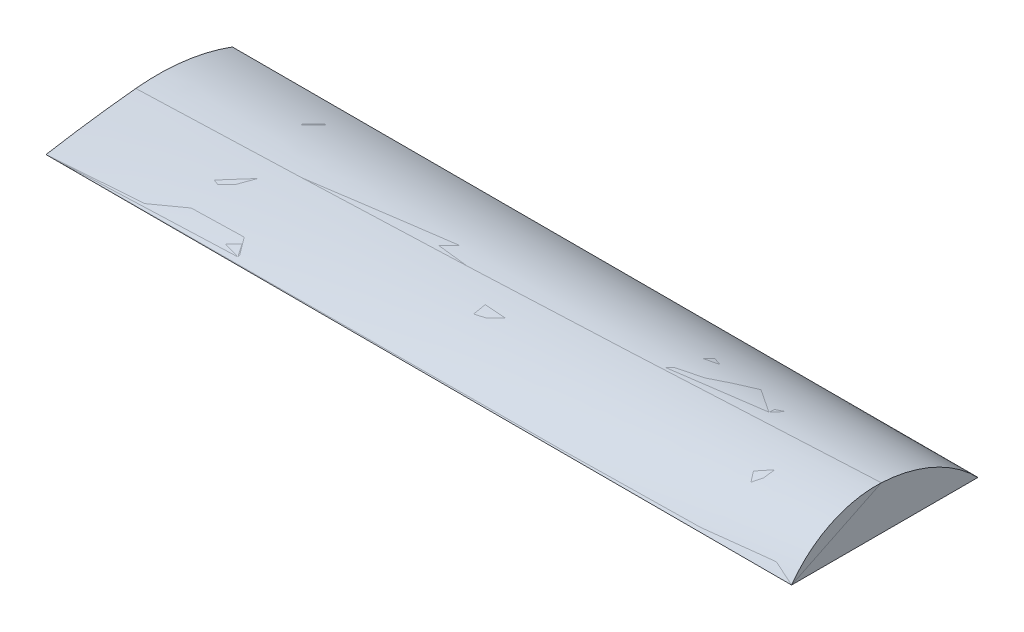
ISO-10303-21;
HEADER;
FILE_DESCRIPTION(('STEP AP214'),'2;1');
FILE_NAME('part.step','',(''),(''),'','','');
FILE_SCHEMA(('AUTOMOTIVE_DESIGN { 1 0 10303 214 1 1 1 1 }'));
ENDSEC;
DATA;
#1=APPLICATION_CONTEXT('core data for automotive mechanical design processes');
#2=APPLICATION_PROTOCOL_DEFINITION('international standard','automotive_design',2000,#1);
#3=PRODUCT_CONTEXT('',#1,'mechanical');
#4=PRODUCT('Part','Part','',(#3));
#5=PRODUCT_RELATED_PRODUCT_CATEGORY('part','',(#4));
#6=PRODUCT_DEFINITION_FORMATION('','',#4);
#7=PRODUCT_DEFINITION_CONTEXT('part definition',#1,'design');
#8=PRODUCT_DEFINITION('design','',#6,#7);
#9=PRODUCT_DEFINITION_SHAPE('','',#8);
#10=(LENGTH_UNIT() NAMED_UNIT(*) SI_UNIT(.MILLI.,.METRE.));
#11=(NAMED_UNIT(*) PLANE_ANGLE_UNIT() SI_UNIT($,.RADIAN.));
#12=(NAMED_UNIT(*) SI_UNIT($,.STERADIAN.) SOLID_ANGLE_UNIT());
#13=UNCERTAINTY_MEASURE_WITH_UNIT(LENGTH_MEASURE(1.E-05),#10,'distance_accuracy_value','');
#14=(GEOMETRIC_REPRESENTATION_CONTEXT(3) GLOBAL_UNCERTAINTY_ASSIGNED_CONTEXT((#13)) GLOBAL_UNIT_ASSIGNED_CONTEXT((#10,
#11,#12)) REPRESENTATION_CONTEXT('',''));
#15=CARTESIAN_POINT('',(0.,0.,0.));
#16=DIRECTION('',(0.,0.,1.));
#17=DIRECTION('',(1.,0.,0.));
#18=AXIS2_PLACEMENT_3D('',#15,#16,#17);
#19=CARTESIAN_POINT('',(3048.,357.029468650609,27.7196009830328));
#20=CARTESIAN_POINT('',(2032.06565410916,305.807060138827,27.7196009830331));
#21=CARTESIAN_POINT('',(0.459460026641767,203.375477990563,27.7196009830337));
#22=CARTESIAN_POINT('',(-2031.93437981395,135.09915754925,27.7196009830325));
#23=CARTESIAN_POINT('',(-3048.,100.965408217149,27.7196009830318));
#24=CARTESIAN_POINT('',(3048.,355.088474416726,-9.18765761877458));
#25=CARTESIAN_POINT('',(2032.06565410916,305.416517274933,-8.33612498554589));
#26=CARTESIAN_POINT('',(0.459460026641767,206.085437260132,-6.63327973857884));
#27=CARTESIAN_POINT('',(-2031.93437981395,138.256317849937,-5.9257886405661));
#28=CARTESIAN_POINT('',(-3048.,104.346140142649,-5.57208879795351));
#29=CARTESIAN_POINT('',(3048.,347.771369274783,-82.8214757845803));
#30=CARTESIAN_POINT('',(2032.06565410916,301.400034870182,-80.4082955218791));
#31=CARTESIAN_POINT('',(0.459460026641989,208.669347512968,-75.5825585153776));
#32=CARTESIAN_POINT('',(-2031.93437981395,142.356994766912,-73.426514928613));
#33=CARTESIAN_POINT('',(-3048.,109.205102403273,-72.3486324231701));
#34=CARTESIAN_POINT('',(3048.,326.584084138001,-191.775336090493));
#35=CARTESIAN_POINT('',(2032.06565410916,285.718343395966,-187.533693604311));
#36=CARTESIAN_POINT('',(0.459460026641101,203.997420825434,-179.051504589966));
#37=CARTESIAN_POINT('',(-2031.93437981395,141.843835621411,-174.860976147701));
#38=CARTESIAN_POINT('',(-3048.,110.771058357894,-172.765982649329));
#39=CARTESIAN_POINT('',(3048.,295.369062928028,-298.290389942061));
#40=CARTESIAN_POINT('',(2032.06565410916,260.50899486405,-292.819188382958));
#41=CARTESIAN_POINT('',(0.459460026640546,190.797865900481,-281.878198916951));
#42=CARTESIAN_POINT('',(-2031.93437981395,134.663233778749,-276.03175468013));
#43=CARTESIAN_POINT('',(-3048.,106.599544211004,-273.108910262419));
#44=CARTESIAN_POINT('',(3047.99999999999,254.39579806938,-401.445762945769));
#45=CARTESIAN_POINT('',(2032.06565410915,225.974502752165,-395.42274883089));
#46=CARTESIAN_POINT('',(0.459460026644765,169.139255628326,-383.378276830975));
#47=CARTESIAN_POINT('',(-2031.93437981395,120.853606673482,-376.493025001473));
#48=CARTESIAN_POINT('',(-3048.,96.7139016174797,-373.050843898016));
#49=CARTESIAN_POINT('',(3048.00000000001,204.018747874501,-500.349717499533));
#50=CARTESIAN_POINT('',(2032.06565410916,182.393619242813,-494.524216022473));
#51=CARTESIAN_POINT('',(0.459460026640546,139.148949492579,-482.874718264766));
#52=CARTESIAN_POINT('',(-2031.93437981395,100.472965583307,-475.801409575772));
#53=CARTESIAN_POINT('',(-3048.,81.1374722321939,-472.265212191698));
#54=CARTESIAN_POINT('',(3047.99999999999,144.673229990741,-594.147072223697));
#55=CARTESIAN_POINT('',(2032.06565410915,130.115112109361,-589.331310253587));
#56=CARTESIAN_POINT('',(0.459460026644321,101.002637881453,-579.701030612708));
#57=CARTESIAN_POINT('',(-2031.93437981395,73.6195841472809,-573.52012772952));
#58=CARTESIAN_POINT('',(-3048.,59.9298263210211,-570.43007559582));
#59=CARTESIAN_POINT('',(3048.00000000001,76.8725640331372,-682.027186144494));
#60=CARTESIAN_POINT('',(2032.06565410916,69.5587832278572,-679.086866649359));
#61=CARTESIAN_POINT('',(0.459460026639436,54.9331113561778,-673.206987380527));
#62=CARTESIAN_POINT('',(-2031.93437981395,40.4107677559007,-669.21782035926));
#63=CARTESIAN_POINT('',(-3048.,33.1505341498355,-667.223494562737));
#64=CARTESIAN_POINT('',(3048.,26.4258089430827,-736.162240464383));
#65=CARTESIAN_POINT('',(2032.06565410916,23.9914846027125,-735.077740652571));
#66=CARTESIAN_POINT('',(0.459460026641767,19.1234649040918,-732.90902124263));
#67=CARTESIAN_POINT('',(-2031.93437981395,14.1394388830836,-731.389406125531));
#68=CARTESIAN_POINT('',(-3048.,11.6477478580526,-730.629696739421));
#69=CARTESIAN_POINT('',(3048.,2.22044604925031E-13,-762.));
#70=CARTESIAN_POINT('',(2032.06565410916,0.,-762.));
#71=CARTESIAN_POINT('',(0.459460026641767,-4.99617109103717E-13,-762.000000000001));
#72=CARTESIAN_POINT('',(-2031.93437981395,1.29547534353127E-13,-762.));
#73=CARTESIAN_POINT('',(-3048.,4.44089209850063E-13,-762.));
#74=B_SPLINE_SURFACE_WITH_KNOTS('',3,3,((#19,#20,#21,#22,#23),(#24,#25,#26,#27,#28),(#29,#30,
#31,#32,#33),(#34,#35,#36,#37,#38),(#39,#40,#41,#42,#43),(#44,#45,#46,#47,#48),(#49,#50,#51,#52,
#53),(#54,#55,#56,#57,#58),(#59,#60,#61,#62,#63),(#64,#65,#66,#67,#68),(#69,#70,#71,#72,#73)),
.UNSPECIFIED.,.F.,.F.,.F.,(4,1,1,1,1,1,1,1,4),(4,1,4),(0.,0.125,0.25,0.375,0.5,0.625,0.75,0.875,
1.),(0.,0.500064603489578,1.),.UNSPECIFIED.);
#75=CARTESIAN_POINT('',(3048.,-833.356731227227,90.3233498819976));
#76=DIRECTION('',(-1.,0.,0.));
#77=DIRECTION('',(0.,0.,-1.));
#78=AXIS2_PLACEMENT_3D('',#75,#76,#77);
#79=CIRCLE('',#78,1192.03126395066);
#80=CARTESIAN_POINT('',(3048.,357.029468650609,27.7196009830328));
#81=VERTEX_POINT('',#80);
#82=CARTESIAN_POINT('',(3048.,2.22044604925031E-13,-762.));
#83=VERTEX_POINT('',#82);
#84=EDGE_CURVE('E178',#81,#83,#79,.T.);
#85=DIRECTION('',(-1.,0.,0.));
#86=VECTOR('',#85,1.);
#87=CARTESIAN_POINT('',(0.393822875752819,0.,-762.));
#88=LINE('',#87,#86);
#89=CARTESIAN_POINT('',(-3048.,2.22044604925031E-13,-762.));
#90=VERTEX_POINT('',#89);
#91=EDGE_CURVE('E180',#83,#90,#88,.T.);
#92=CARTESIAN_POINT('',(-3048.,-1648.45305250207,-149.931785297438));
#93=DIRECTION('',(-1.,0.,0.));
#94=DIRECTION('',(0.,0.,-1.));
#95=AXIS2_PLACEMENT_3D('',#92,#93,#94);
#96=CIRCLE('',#95,1758.41547017551);
#97=CARTESIAN_POINT('',(-3048.,100.965408217149,27.7196009830318));
#98=VERTEX_POINT('',#97);
#99=EDGE_CURVE('E195',#98,#90,#96,.T.);
#100=CARTESIAN_POINT('',(3048.,357.029468650609,27.7196009830328));
#101=CARTESIAN_POINT('',(2032.06565410916,305.807060138827,27.7196009830331));
#102=CARTESIAN_POINT('',(0.459460026641767,203.375477990563,27.7196009830336));
#103=CARTESIAN_POINT('',(-2031.93437981395,135.09915754925,27.7196009830324));
#104=CARTESIAN_POINT('',(-3048.,100.965408217149,27.7196009830318));
#105=B_SPLINE_CURVE_WITH_KNOTS('',3,(#100,#101,#102,#103,#104),.UNSPECIFIED.,.F.,.F.,(4,1,4),
(0.,0.500064603489578,1.),.UNSPECIFIED.);
#106=EDGE_CURVE('E183',#81,#98,#105,.T.);
#107=ORIENTED_EDGE('',*,*,#84,.T.);
#108=ORIENTED_EDGE('',*,*,#91,.T.);
#109=ORIENTED_EDGE('',*,*,#99,.F.);
#110=ORIENTED_EDGE('',*,*,#106,.F.);
#111=EDGE_LOOP('',(#107,#108,#109,#110));
#112=FACE_BOUND('',#111,.T.);
#113=ADVANCED_FACE('F133',(#112),#74,.T.);
#114=CARTESIAN_POINT('',(-3048.,-10303.5740928413,-1028.84914313158));
#115=DIRECTION('',(-1.,0.,0.));
#116=DIRECTION('',(0.,0.,1.));
#117=AXIS2_PLACEMENT_3D('',#114,#115,#116);
#118=PLANE('',#117);
#119=ORIENTED_EDGE('',*,*,#99,.T.);
#120=DIRECTION('',(0.,0.,1.));
#121=VECTOR('',#120,1.);
#122=CARTESIAN_POINT('',(-3048.,1.11022302462516E-13,0.));
#123=LINE('',#122,#121);
#124=CARTESIAN_POINT('',(-3048.,0.,762.));
#125=VERTEX_POINT('',#124);
#126=EDGE_CURVE('E162',#90,#125,#123,.T.);
#127=ORIENTED_EDGE('',*,*,#126,.T.);
#128=CARTESIAN_POINT('',(-3048.,-10303.5740928413,-1028.84914313158));
#129=DIRECTION('',(-1.,0.,0.));
#130=DIRECTION('',(0.,0.,-1.));
#131=AXIS2_PLACEMENT_3D('',#128,#129,#130);
#132=CIRCLE('',#131,10458.048562716);
#133=EDGE_CURVE('E203',#125,#98,#132,.T.);
#134=ORIENTED_EDGE('',*,*,#133,.T.);
#135=EDGE_LOOP('',(#119,#127,#134));
#136=FACE_BOUND('',#135,.T.);
#137=ADVANCED_FACE('F328',(#136),#118,.T.);
#138=CARTESIAN_POINT('',(3048.,2.22044604925031E-13,-762.));
#139=DIRECTION('',(0.,-1.,0.));
#140=DIRECTION('',(0.,0.,1.));
#141=AXIS2_PLACEMENT_3D('',#138,#139,#140);
#142=PLANE('',#141);
#143=DIRECTION('',(0.,0.,1.));
#144=VECTOR('',#143,1.);
#145=CARTESIAN_POINT('',(3048.,1.11022302462516E-13,0.));
#146=LINE('',#145,#144);
#147=CARTESIAN_POINT('',(3048.,1.66533453693773E-13,762.));
#148=VERTEX_POINT('',#147);
#149=EDGE_CURVE('E153',#83,#148,#146,.T.);
#150=ORIENTED_EDGE('',*,*,#149,.T.);
#151=DIRECTION('',(-1.,0.,0.));
#152=VECTOR('',#151,1.);
#153=CARTESIAN_POINT('',(0.393822875752819,2.22055364725921E-13,761.999999999999));
#154=LINE('',#153,#152);
#155=EDGE_CURVE('E146',#148,#125,#154,.T.);
#156=ORIENTED_EDGE('',*,*,#155,.T.);
#157=ORIENTED_EDGE('',*,*,#126,.F.);
#158=ORIENTED_EDGE('',*,*,#91,.F.);
#159=EDGE_LOOP('',(#150,#156,#157,#158));
#160=FACE_BOUND('',#159,.T.);
#161=ADVANCED_FACE('F192',(#160),#142,.T.);
#162=CARTESIAN_POINT('',(3048.,-485.437757623856,72.0258998083268));
#163=DIRECTION('',(-1.,0.,0.));
#164=DIRECTION('',(0.,0.,1.));
#165=AXIS2_PLACEMENT_3D('',#162,#163,#164);
#166=PLANE('',#165);
#167=CARTESIAN_POINT('',(3048.,-485.437757623856,72.0258998083268));
#168=DIRECTION('',(-1.,0.,0.));
#169=DIRECTION('',(0.,0.,-1.));
#170=AXIS2_PLACEMENT_3D('',#167,#168,#169);
#171=CIRCLE('',#170,843.631480838753);
#172=EDGE_CURVE('E13',#148,#81,#171,.T.);
#173=ORIENTED_EDGE('',*,*,#172,.F.);
#174=ORIENTED_EDGE('',*,*,#149,.F.);
#175=ORIENTED_EDGE('',*,*,#84,.F.);
#176=EDGE_LOOP('',(#173,#174,#175));
#177=FACE_BOUND('',#176,.T.);
#178=ADVANCED_FACE('F200',(#177),#166,.F.);
#179=CARTESIAN_POINT('',(3048.,1.66533453693773E-13,762.));
#180=CARTESIAN_POINT('',(2032.06565410916,2.0817458848352E-13,762.));
#181=CARTESIAN_POINT('',(0.459460026641767,2.91446098802716E-13,761.999999999999));
#182=CARTESIAN_POINT('',(-2031.93437981395,0.,762.));
#183=CARTESIAN_POINT('',(-3048.,0.,762.));
#184=CARTESIAN_POINT('',(3048.,29.0429711531695,741.566544907392));
#185=CARTESIAN_POINT('',(2032.06565410916,24.2371026730112,738.550355351954));
#186=CARTESIAN_POINT('',(0.459460026641767,14.6266074557498,732.518755565864));
#187=CARTESIAN_POINT('',(-2031.93437981395,8.4016222990255,731.884160631592));
#188=CARTESIAN_POINT('',(-3048.,5.28953187642705,731.566904161504));
#189=CARTESIAN_POINT('',(3048.,84.5453723552376,697.027775172461));
#190=CARTESIAN_POINT('',(2032.06565410916,70.4457511191001,689.08358478242));
#191=CARTESIAN_POINT('',(0.459460026641323,42.2501517150495,673.197256626809));
#192=CARTESIAN_POINT('',(-2031.93437981395,24.4819010655734,671.501573315269));
#193=CARTESIAN_POINT('',(-3048.,15.5989236318311,670.653841206558));
#194=CARTESIAN_POINT('',(3048.,158.721372485365,620.265381851068));
#195=CARTESIAN_POINT('',(2032.06565410916,132.12375937084,607.933020626898));
#196=CARTESIAN_POINT('',(0.459460026642766,78.9354054483259,583.271484621126));
#197=CARTESIAN_POINT('',(-2031.93437981395,46.4789445969054,580.524251156607));
#198=CARTESIAN_POINT('',(-3048.,30.2528109718255,579.150811905216));
#199=CARTESIAN_POINT('',(3048.00000000001,222.639379242981,534.772697088081));
#200=CARTESIAN_POINT('',(2032.06565410916,185.414016794622,520.678936224319));
#201=CARTESIAN_POINT('',(0.459460026639769,110.972910208411,492.495056050811));
#202=CARTESIAN_POINT('',(-2031.93437981395,66.3859255649033,489.179227007448));
#203=CARTESIAN_POINT('',(-3048.,44.0953137179471,487.521526699893));
#204=CARTESIAN_POINT('',(3047.99999999999,275.280986029378,441.910495941741));
#205=CARTESIAN_POINT('',(2032.06565410915,229.67378287563,428.254517465996));
#206=CARTESIAN_POINT('',(0.459460026644987,138.47116058345,400.94608895406));
#207=CARTESIAN_POINT('',(-2031.93437981395,84.238303362931,397.497337764328));
#208=CARTESIAN_POINT('',(-3048.,57.1253783844976,395.773184970824));
#209=CARTESIAN_POINT('',(3048.,315.808296145767,343.157955207196));
#210=CARTESIAN_POINT('',(2032.06565410916,264.365612597069,331.662016648247));
#211=CARTESIAN_POINT('',(0.459460026640768,161.493537289764,308.67310985755));
#212=CARTESIAN_POINT('',(-2031.93437981395,100.056500722473,305.499557336302));
#213=CARTESIAN_POINT('',(-3048.,69.3419514857788,303.912986098246));
#214=CARTESIAN_POINT('',(3048.,343.575379924687,240.087591890367));
#215=CARTESIAN_POINT('',(2032.06565410916,289.07946806479,231.962587520926));
#216=CARTESIAN_POINT('',(0.459460026640768,180.101725029969,215.714678125336));
#217=CARTESIAN_POINT('',(-2031.93437981395,113.860458253997,213.203548966914));
#218=CARTESIAN_POINT('',(-3048.,80.7441042829981,211.94814661541));
#219=CARTESIAN_POINT('',(3047.99999999999,358.140910336441,134.340774692125));
#220=CARTESIAN_POINT('',(2032.06565410915,303.52466072033,130.257546581266));
#221=CARTESIAN_POINT('',(0.459460026642988,194.306273266018,122.092145386369));
#222=CARTESIAN_POINT('',(-2031.93437981395,125.653072956041,120.621240482108));
#223=CARTESIAN_POINT('',(-3048.,91.3309080373627,119.885883055567));
#224=CARTESIAN_POINT('',(3048.,358.894446710407,63.1814412802017));
#225=CARTESIAN_POINT('',(2032.06565410916,306.207053153412,61.8698764540038));
#226=CARTESIAN_POINT('',(0.459460026641767,200.845879438396,59.2470856844804));
#227=CARTESIAN_POINT('',(-2031.93437981395,132.1754553575,58.7162808688702));
#228=CARTESIAN_POINT('',(-3048.,97.8446796660789,58.4509127529084));
#229=CARTESIAN_POINT('',(3048.,357.029468650609,27.7196009830328));
#230=CARTESIAN_POINT('',(2032.06565410916,305.807060138827,27.7196009830331));
#231=CARTESIAN_POINT('',(0.459460026641767,203.375477990563,27.7196009830336));
#232=CARTESIAN_POINT('',(-2031.93437981395,135.09915754925,27.7196009830324));
#233=CARTESIAN_POINT('',(-3048.,100.965408217149,27.7196009830318));
#234=B_SPLINE_SURFACE_WITH_KNOTS('',3,3,((#179,#180,#181,#182,#183),(#184,#185,#186,#187,#188),
(#189,#190,#191,#192,#193),(#194,#195,#196,#197,#198),(#199,#200,#201,#202,#203),(#204,#205,
#206,#207,#208),(#209,#210,#211,#212,#213),(#214,#215,#216,#217,#218),(#219,#220,#221,#222,
#223),(#224,#225,#226,#227,#228),(#229,#230,#231,#232,#233)),.UNSPECIFIED.,.F.,.F.,.F.,(4,1,1,1,
1,1,1,1,4),(4,1,4),(0.,0.125,0.25,0.375,0.5,0.625,0.75,0.875,1.),(0.,0.500064603489578,1.),.UNSPECIFIED.);
#235=ORIENTED_EDGE('',*,*,#172,.T.);
#236=ORIENTED_EDGE('',*,*,#106,.T.);
#237=ORIENTED_EDGE('',*,*,#133,.F.);
#238=ORIENTED_EDGE('',*,*,#155,.F.);
#239=EDGE_LOOP('',(#235,#236,#237,#238));
#240=FACE_BOUND('',#239,.T.);
#241=ADVANCED_FACE('F135',(#240),#234,.T.);
#242=CLOSED_SHELL('',(#113,#137,#161,#178,#241));
#243=MANIFOLD_SOLID_BREP('B2',#242);
#244=CARTESIAN_POINT('',(3048.,357.029468650609,27.7196009830328));
#245=CARTESIAN_POINT('',(2032.06565410916,305.807060138827,27.7196009830331));
#246=CARTESIAN_POINT('',(0.459460026641767,203.375477990563,27.7196009830337));
#247=CARTESIAN_POINT('',(-2031.93437981395,135.09915754925,27.7196009830325));
#248=CARTESIAN_POINT('',(-3048.,100.965408217149,27.7196009830318));
#249=CARTESIAN_POINT('',(3048.,355.088474416726,-9.18765761877458));
#250=CARTESIAN_POINT('',(2032.06565410916,305.416517274933,-8.33612498554589));
#251=CARTESIAN_POINT('',(0.459460026641767,206.085437260132,-6.63327973857884));
#252=CARTESIAN_POINT('',(-2031.93437981395,138.256317849937,-5.9257886405661));
#253=CARTESIAN_POINT('',(-3048.,104.346140142649,-5.57208879795351));
#254=CARTESIAN_POINT('',(3048.,347.771369274783,-82.8214757845803));
#255=CARTESIAN_POINT('',(2032.06565410916,301.400034870182,-80.4082955218791));
#256=CARTESIAN_POINT('',(0.459460026641989,208.669347512968,-75.5825585153776));
#257=CARTESIAN_POINT('',(-2031.93437981395,142.356994766912,-73.426514928613));
#258=CARTESIAN_POINT('',(-3048.,109.205102403273,-72.3486324231701));
#259=CARTESIAN_POINT('',(3048.,326.584084138001,-191.775336090493));
#260=CARTESIAN_POINT('',(2032.06565410916,285.718343395966,-187.533693604311));
#261=CARTESIAN_POINT('',(0.459460026641101,203.997420825434,-179.051504589966));
#262=CARTESIAN_POINT('',(-2031.93437981395,141.843835621411,-174.860976147701));
#263=CARTESIAN_POINT('',(-3048.,110.771058357894,-172.765982649329));
#264=CARTESIAN_POINT('',(3048.,295.369062928028,-298.290389942061));
#265=CARTESIAN_POINT('',(2032.06565410916,260.50899486405,-292.819188382958));
#266=CARTESIAN_POINT('',(0.459460026640546,190.797865900481,-281.878198916951));
#267=CARTESIAN_POINT('',(-2031.93437981395,134.663233778749,-276.03175468013));
#268=CARTESIAN_POINT('',(-3048.,106.599544211004,-273.108910262419));
#269=CARTESIAN_POINT('',(3047.99999999999,254.39579806938,-401.445762945769));
#270=CARTESIAN_POINT('',(2032.06565410915,225.974502752165,-395.42274883089));
#271=CARTESIAN_POINT('',(0.459460026644765,169.139255628326,-383.378276830975));
#272=CARTESIAN_POINT('',(-2031.93437981395,120.853606673482,-376.493025001473));
#273=CARTESIAN_POINT('',(-3048.,96.7139016174797,-373.050843898016));
#274=CARTESIAN_POINT('',(3048.00000000001,204.018747874501,-500.349717499533));
#275=CARTESIAN_POINT('',(2032.06565410916,182.393619242813,-494.524216022473));
#276=CARTESIAN_POINT('',(0.459460026640546,139.148949492579,-482.874718264766));
#277=CARTESIAN_POINT('',(-2031.93437981395,100.472965583307,-475.801409575772));
#278=CARTESIAN_POINT('',(-3048.,81.1374722321939,-472.265212191698));
#279=CARTESIAN_POINT('',(3047.99999999999,144.673229990741,-594.147072223697));
#280=CARTESIAN_POINT('',(2032.06565410915,130.115112109361,-589.331310253587));
#281=CARTESIAN_POINT('',(0.459460026644321,101.002637881453,-579.701030612708));
#282=CARTESIAN_POINT('',(-2031.93437981395,73.6195841472809,-573.52012772952));
#283=CARTESIAN_POINT('',(-3048.,59.9298263210211,-570.43007559582));
#284=CARTESIAN_POINT('',(3048.00000000001,76.8725640331372,-682.027186144494));
#285=CARTESIAN_POINT('',(2032.06565410916,69.5587832278572,-679.086866649359));
#286=CARTESIAN_POINT('',(0.459460026639436,54.9331113561778,-673.206987380527));
#287=CARTESIAN_POINT('',(-2031.93437981395,40.4107677559007,-669.21782035926));
#288=CARTESIAN_POINT('',(-3048.,33.1505341498355,-667.223494562737));
#289=CARTESIAN_POINT('',(3048.,26.4258089430827,-736.162240464383));
#290=CARTESIAN_POINT('',(2032.06565410916,23.9914846027125,-735.077740652571));
#291=CARTESIAN_POINT('',(0.459460026641767,19.1234649040918,-732.90902124263));
#292=CARTESIAN_POINT('',(-2031.93437981395,14.1394388830836,-731.389406125531));
#293=CARTESIAN_POINT('',(-3048.,11.6477478580526,-730.629696739421));
#294=CARTESIAN_POINT('',(3048.,2.22044604925031E-13,-762.));
#295=CARTESIAN_POINT('',(2032.06565410916,0.,-762.));
#296=CARTESIAN_POINT('',(0.459460026641767,-4.99617109103717E-13,-762.000000000001));
#297=CARTESIAN_POINT('',(-2031.93437981395,1.29547534353127E-13,-762.));
#298=CARTESIAN_POINT('',(-3048.,4.44089209850063E-13,-762.));
#299=B_SPLINE_SURFACE_WITH_KNOTS('',3,3,((#244,#245,#246,#247,#248),(#249,#250,#251,#252,#253),
(#254,#255,#256,#257,#258),(#259,#260,#261,#262,#263),(#264,#265,#266,#267,#268),(#269,#270,
#271,#272,#273),(#274,#275,#276,#277,#278),(#279,#280,#281,#282,#283),(#284,#285,#286,#287,
#288),(#289,#290,#291,#292,#293),(#294,#295,#296,#297,#298)),.UNSPECIFIED.,.F.,.F.,.F.,(4,1,1,1,
1,1,1,1,4),(4,1,4),(0.,0.125,0.25,0.375,0.5,0.625,0.75,0.875,1.),(0.,0.500064603489578,1.),.UNSPECIFIED.);
#300=CARTESIAN_POINT('',(3048.,-833.356731227227,90.3233498819976));
#301=DIRECTION('',(-1.,0.,0.));
#302=DIRECTION('',(0.,0.,-1.));
#303=AXIS2_PLACEMENT_3D('',#300,#301,#302);
#304=CIRCLE('',#303,1192.03126395066);
#305=CARTESIAN_POINT('',(3048.,357.029468650609,27.7196009830328));
#306=VERTEX_POINT('',#305);
#307=CARTESIAN_POINT('',(3048.,2.22044604925031E-13,-762.));
#308=VERTEX_POINT('',#307);
#309=EDGE_CURVE('E131',#306,#308,#304,.T.);
#310=DIRECTION('',(-1.,0.,0.));
#311=VECTOR('',#310,1.);
#312=CARTESIAN_POINT('',(0.393822875752819,0.,-762.));
#313=LINE('',#312,#311);
#314=CARTESIAN_POINT('',(-3048.,2.22044604925031E-13,-762.));
#315=VERTEX_POINT('',#314);
#316=EDGE_CURVE('E469',#308,#315,#313,.T.);
#317=CARTESIAN_POINT('',(-3048.,-1648.45305250207,-149.931785297438));
#318=DIRECTION('',(-1.,0.,0.));
#319=DIRECTION('',(0.,0.,-1.));
#320=AXIS2_PLACEMENT_3D('',#317,#318,#319);
#321=CIRCLE('',#320,1758.41547017551);
#322=CARTESIAN_POINT('',(-3048.,100.965408217149,27.7196009830318));
#323=VERTEX_POINT('',#322);
#324=EDGE_CURVE('E521',#323,#315,#321,.T.);
#325=CARTESIAN_POINT('',(3048.,357.029468650609,27.7196009830328));
#326=CARTESIAN_POINT('',(2032.06565410916,305.807060138827,27.7196009830331));
#327=CARTESIAN_POINT('',(0.459460026641767,203.375477990563,27.7196009830336));
#328=CARTESIAN_POINT('',(-2031.93437981395,135.09915754925,27.7196009830324));
#329=CARTESIAN_POINT('',(-3048.,100.965408217149,27.7196009830318));
#330=B_SPLINE_CURVE_WITH_KNOTS('',3,(#325,#326,#327,#328,#329),.UNSPECIFIED.,.F.,.F.,(4,1,4),
(0.,0.500064603489578,1.),.UNSPECIFIED.);
#331=EDGE_CURVE('E503',#306,#323,#330,.T.);
#332=ORIENTED_EDGE('',*,*,#309,.T.);
#333=ORIENTED_EDGE('',*,*,#316,.T.);
#334=ORIENTED_EDGE('',*,*,#324,.F.);
#335=ORIENTED_EDGE('',*,*,#331,.F.);
#336=EDGE_LOOP('',(#332,#333,#334,#335));
#337=FACE_BOUND('',#336,.T.);
#338=ADVANCED_FACE('F457',(#337),#299,.T.);
#339=CARTESIAN_POINT('',(3048.,2.22044604925031E-13,-762.));
#340=DIRECTION('',(0.,-1.,0.));
#341=DIRECTION('',(0.,0.,1.));
#342=AXIS2_PLACEMENT_3D('',#339,#340,#341);
#343=PLANE('',#342);
#344=DIRECTION('',(0.,0.,1.));
#345=VECTOR('',#344,1.);
#346=CARTESIAN_POINT('',(3048.,1.11022302462516E-13,0.));
#347=LINE('',#346,#345);
#348=CARTESIAN_POINT('',(3048.,1.66533453693773E-13,762.));
#349=VERTEX_POINT('',#348);
#350=EDGE_CURVE('E478',#308,#349,#347,.T.);
#351=ORIENTED_EDGE('',*,*,#350,.T.);
#352=DIRECTION('',(-1.,0.,0.));
#353=VECTOR('',#352,1.);
#354=CARTESIAN_POINT('',(0.393822875752819,2.22055364725921E-13,761.999999999999));
#355=LINE('',#354,#353);
#356=CARTESIAN_POINT('',(-3048.,0.,762.));
#357=VERTEX_POINT('',#356);
#358=EDGE_CURVE('E506',#349,#357,#355,.T.);
#359=ORIENTED_EDGE('',*,*,#358,.T.);
#360=DIRECTION('',(0.,0.,1.));
#361=VECTOR('',#360,1.);
#362=CARTESIAN_POINT('',(-3048.,1.11022302462516E-13,0.));
#363=LINE('',#362,#361);
#364=EDGE_CURVE('E632',#315,#357,#363,.T.);
#365=ORIENTED_EDGE('',*,*,#364,.F.);
#366=ORIENTED_EDGE('',*,*,#316,.F.);
#367=EDGE_LOOP('',(#351,#359,#365,#366));
#368=FACE_BOUND('',#367,.T.);
#369=ADVANCED_FACE('F459',(#368),#343,.T.);
#370=CARTESIAN_POINT('',(3048.,1.66533453693773E-13,762.));
#371=CARTESIAN_POINT('',(2032.06565410916,2.0817458848352E-13,762.));
#372=CARTESIAN_POINT('',(0.459460026641767,2.91446098802716E-13,761.999999999999));
#373=CARTESIAN_POINT('',(-2031.93437981395,0.,762.));
#374=CARTESIAN_POINT('',(-3048.,0.,762.));
#375=CARTESIAN_POINT('',(3048.,29.0429711531695,741.566544907392));
#376=CARTESIAN_POINT('',(2032.06565410916,24.2371026730112,738.550355351954));
#377=CARTESIAN_POINT('',(0.459460026641767,14.6266074557498,732.518755565864));
#378=CARTESIAN_POINT('',(-2031.93437981395,8.4016222990255,731.884160631592));
#379=CARTESIAN_POINT('',(-3048.,5.28953187642705,731.566904161504));
#380=CARTESIAN_POINT('',(3048.,84.5453723552376,697.027775172461));
#381=CARTESIAN_POINT('',(2032.06565410916,70.4457511191001,689.08358478242));
#382=CARTESIAN_POINT('',(0.459460026641323,42.2501517150495,673.197256626809));
#383=CARTESIAN_POINT('',(-2031.93437981395,24.4819010655734,671.501573315269));
#384=CARTESIAN_POINT('',(-3048.,15.5989236318311,670.653841206558));
#385=CARTESIAN_POINT('',(3048.,158.721372485365,620.265381851068));
#386=CARTESIAN_POINT('',(2032.06565410916,132.12375937084,607.933020626898));
#387=CARTESIAN_POINT('',(0.459460026642766,78.9354054483259,583.271484621126));
#388=CARTESIAN_POINT('',(-2031.93437981395,46.4789445969054,580.524251156607));
#389=CARTESIAN_POINT('',(-3048.,30.2528109718255,579.150811905216));
#390=CARTESIAN_POINT('',(3048.00000000001,222.639379242981,534.772697088081));
#391=CARTESIAN_POINT('',(2032.06565410916,185.414016794622,520.678936224319));
#392=CARTESIAN_POINT('',(0.459460026639769,110.972910208411,492.495056050811));
#393=CARTESIAN_POINT('',(-2031.93437981395,66.3859255649033,489.179227007448));
#394=CARTESIAN_POINT('',(-3048.,44.0953137179471,487.521526699893));
#395=CARTESIAN_POINT('',(3047.99999999999,275.280986029378,441.910495941741));
#396=CARTESIAN_POINT('',(2032.06565410915,229.67378287563,428.254517465996));
#397=CARTESIAN_POINT('',(0.459460026644987,138.47116058345,400.94608895406));
#398=CARTESIAN_POINT('',(-2031.93437981395,84.238303362931,397.497337764328));
#399=CARTESIAN_POINT('',(-3048.,57.1253783844976,395.773184970824));
#400=CARTESIAN_POINT('',(3048.,315.808296145767,343.157955207196));
#401=CARTESIAN_POINT('',(2032.06565410916,264.365612597069,331.662016648247));
#402=CARTESIAN_POINT('',(0.459460026640768,161.493537289764,308.67310985755));
#403=CARTESIAN_POINT('',(-2031.93437981395,100.056500722473,305.499557336302));
#404=CARTESIAN_POINT('',(-3048.,69.3419514857788,303.912986098246));
#405=CARTESIAN_POINT('',(3048.,343.575379924687,240.087591890367));
#406=CARTESIAN_POINT('',(2032.06565410916,289.07946806479,231.962587520926));
#407=CARTESIAN_POINT('',(0.459460026640768,180.101725029969,215.714678125336));
#408=CARTESIAN_POINT('',(-2031.93437981395,113.860458253997,213.203548966914));
#409=CARTESIAN_POINT('',(-3048.,80.7441042829981,211.94814661541));
#410=CARTESIAN_POINT('',(3047.99999999999,358.140910336441,134.340774692125));
#411=CARTESIAN_POINT('',(2032.06565410915,303.52466072033,130.257546581266));
#412=CARTESIAN_POINT('',(0.459460026642988,194.306273266018,122.092145386369));
#413=CARTESIAN_POINT('',(-2031.93437981395,125.653072956041,120.621240482108));
#414=CARTESIAN_POINT('',(-3048.,91.3309080373627,119.885883055567));
#415=CARTESIAN_POINT('',(3048.,358.894446710407,63.1814412802017));
#416=CARTESIAN_POINT('',(2032.06565410916,306.207053153412,61.8698764540038));
#417=CARTESIAN_POINT('',(0.459460026641767,200.845879438396,59.2470856844804));
#418=CARTESIAN_POINT('',(-2031.93437981395,132.1754553575,58.7162808688702));
#419=CARTESIAN_POINT('',(-3048.,97.8446796660789,58.4509127529084));
#420=CARTESIAN_POINT('',(3048.,357.029468650609,27.7196009830328));
#421=CARTESIAN_POINT('',(2032.06565410916,305.807060138827,27.7196009830331));
#422=CARTESIAN_POINT('',(0.459460026641767,203.375477990563,27.7196009830336));
#423=CARTESIAN_POINT('',(-2031.93437981395,135.09915754925,27.7196009830324));
#424=CARTESIAN_POINT('',(-3048.,100.965408217149,27.7196009830318));
#425=B_SPLINE_SURFACE_WITH_KNOTS('',3,3,((#370,#371,#372,#373,#374),(#375,#376,#377,#378,#379),
(#380,#381,#382,#383,#384),(#385,#386,#387,#388,#389),(#390,#391,#392,#393,#394),(#395,#396,
#397,#398,#399),(#400,#401,#402,#403,#404),(#405,#406,#407,#408,#409),(#410,#411,#412,#413,
#414),(#415,#416,#417,#418,#419),(#420,#421,#422,#423,#424)),.UNSPECIFIED.,.F.,.F.,.F.,(4,1,1,1,
1,1,1,1,4),(4,1,4),(0.,0.125,0.25,0.375,0.5,0.625,0.75,0.875,1.),(0.,0.500064603489578,1.),.UNSPECIFIED.);
#426=CARTESIAN_POINT('',(3048.,-485.437757623856,72.0258998083268));
#427=DIRECTION('',(-1.,0.,0.));
#428=DIRECTION('',(0.,0.,-1.));
#429=AXIS2_PLACEMENT_3D('',#426,#427,#428);
#430=CIRCLE('',#429,843.631480838753);
#431=EDGE_CURVE('E499',#349,#306,#430,.T.);
#432=CARTESIAN_POINT('',(-3048.,-10303.5740928413,-1028.84914313158));
#433=DIRECTION('',(-1.,0.,0.));
#434=DIRECTION('',(0.,0.,-1.));
#435=AXIS2_PLACEMENT_3D('',#432,#433,#434);
#436=CIRCLE('',#435,10458.048562716);
#437=EDGE_CURVE('E492',#357,#323,#436,.T.);
#438=ORIENTED_EDGE('',*,*,#431,.T.);
#439=ORIENTED_EDGE('',*,*,#331,.T.);
#440=ORIENTED_EDGE('',*,*,#437,.F.);
#441=ORIENTED_EDGE('',*,*,#358,.F.);
#442=EDGE_LOOP('',(#438,#439,#440,#441));
#443=FACE_BOUND('',#442,.T.);
#444=ADVANCED_FACE('F501',(#443),#425,.T.);
#445=CARTESIAN_POINT('',(3048.,-485.437757623856,72.0258998083268));
#446=DIRECTION('',(-1.,0.,0.));
#447=DIRECTION('',(0.,0.,1.));
#448=AXIS2_PLACEMENT_3D('',#445,#446,#447);
#449=PLANE('',#448);
#450=ORIENTED_EDGE('',*,*,#431,.F.);
#451=ORIENTED_EDGE('',*,*,#350,.F.);
#452=ORIENTED_EDGE('',*,*,#309,.F.);
#453=EDGE_LOOP('',(#450,#451,#452));
#454=FACE_BOUND('',#453,.T.);
#455=ADVANCED_FACE('F513',(#454),#449,.F.);
#456=CARTESIAN_POINT('',(-3048.,-10303.5740928413,-1028.84914313158));
#457=DIRECTION('',(-1.,0.,0.));
#458=DIRECTION('',(0.,0.,1.));
#459=AXIS2_PLACEMENT_3D('',#456,#457,#458);
#460=PLANE('',#459);
#461=ORIENTED_EDGE('',*,*,#324,.T.);
#462=ORIENTED_EDGE('',*,*,#364,.T.);
#463=ORIENTED_EDGE('',*,*,#437,.T.);
#464=EDGE_LOOP('',(#461,#462,#463));
#465=FACE_BOUND('',#464,.T.);
#466=ADVANCED_FACE('F601',(#465),#460,.T.);
#467=CLOSED_SHELL('',(#338,#369,#444,#455,#466));
#468=MANIFOLD_SOLID_BREP('B7',#467);
#469=ADVANCED_BREP_SHAPE_REPRESENTATION('',(#18,#243,#468),#14);
#470=SHAPE_DEFINITION_REPRESENTATION(#9,#469);
ENDSEC;
END-ISO-10303-21;
